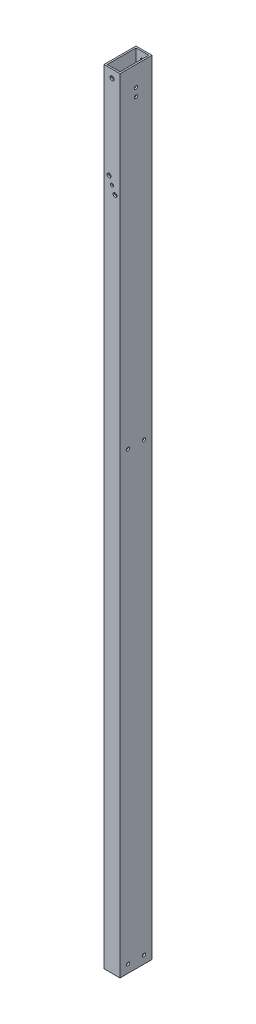
ISO-10303-21;
HEADER;
FILE_DESCRIPTION(('STEP AP214'),'2;1');
FILE_NAME('part.step','',(''),(''),'','','');
FILE_SCHEMA(('AUTOMOTIVE_DESIGN { 1 0 10303 214 1 1 1 1 }'));
ENDSEC;
DATA;
#1=APPLICATION_CONTEXT('core data for automotive mechanical design processes');
#2=APPLICATION_PROTOCOL_DEFINITION('international standard','automotive_design',2000,#1);
#3=PRODUCT_CONTEXT('',#1,'mechanical');
#4=PRODUCT('Part','Part','',(#3));
#5=PRODUCT_RELATED_PRODUCT_CATEGORY('part','',(#4));
#6=PRODUCT_DEFINITION_FORMATION('','',#4);
#7=PRODUCT_DEFINITION_CONTEXT('part definition',#1,'design');
#8=PRODUCT_DEFINITION('design','',#6,#7);
#9=PRODUCT_DEFINITION_SHAPE('','',#8);
#10=(LENGTH_UNIT() NAMED_UNIT(*) SI_UNIT(.MILLI.,.METRE.));
#11=(NAMED_UNIT(*) PLANE_ANGLE_UNIT() SI_UNIT($,.RADIAN.));
#12=(NAMED_UNIT(*) SI_UNIT($,.STERADIAN.) SOLID_ANGLE_UNIT());
#13=UNCERTAINTY_MEASURE_WITH_UNIT(LENGTH_MEASURE(1.E-05),#10,'distance_accuracy_value','');
#14=(GEOMETRIC_REPRESENTATION_CONTEXT(3) GLOBAL_UNCERTAINTY_ASSIGNED_CONTEXT((#13)) GLOBAL_UNIT_ASSIGNED_CONTEXT((#10,
#11,#12)) REPRESENTATION_CONTEXT('',''));
#15=CARTESIAN_POINT('',(0.,0.,0.));
#16=DIRECTION('',(0.,0.,1.));
#17=DIRECTION('',(1.,0.,0.));
#18=AXIS2_PLACEMENT_3D('',#15,#16,#17);
#19=CARTESIAN_POINT('',(0.,1244.6,0.));
#20=DIRECTION('',(0.,1.,0.));
#21=DIRECTION('',(0.,0.,1.));
#22=AXIS2_PLACEMENT_3D('',#19,#20,#21);
#23=PLANE('',#22);
#24=DIRECTION('',(0.,0.,1.));
#25=VECTOR('',#24,1.);
#26=CARTESIAN_POINT('',(0.,1244.6,0.));
#27=LINE('',#26,#25);
#28=CARTESIAN_POINT('',(0.,1244.6,-50.8));
#29=VERTEX_POINT('',#28);
#30=CARTESIAN_POINT('',(0.,1244.6,0.));
#31=VERTEX_POINT('',#30);
#32=EDGE_CURVE('E161',#29,#31,#27,.T.);
#33=ORIENTED_EDGE('',*,*,#32,.T.);
#34=DIRECTION('',(1.,0.,0.));
#35=VECTOR('',#34,1.);
#36=CARTESIAN_POINT('',(0.,1244.6,0.));
#37=LINE('',#36,#35);
#38=CARTESIAN_POINT('',(25.4,1244.6,0.));
#39=VERTEX_POINT('',#38);
#40=EDGE_CURVE('E164',#31,#39,#37,.T.);
#41=ORIENTED_EDGE('',*,*,#40,.T.);
#42=DIRECTION('',(0.,0.,-1.));
#43=VECTOR('',#42,1.);
#44=CARTESIAN_POINT('',(25.4,1244.6,0.));
#45=LINE('',#44,#43);
#46=CARTESIAN_POINT('',(25.4,1244.6,-50.8));
#47=VERTEX_POINT('',#46);
#48=EDGE_CURVE('E167',#39,#47,#45,.T.);
#49=ORIENTED_EDGE('',*,*,#48,.T.);
#50=DIRECTION('',(-1.,0.,0.));
#51=VECTOR('',#50,1.);
#52=CARTESIAN_POINT('',(0.,1244.6,-50.8));
#53=LINE('',#52,#51);
#54=EDGE_CURVE('E169',#47,#29,#53,.T.);
#55=ORIENTED_EDGE('',*,*,#54,.T.);
#56=EDGE_LOOP('',(#33,#41,#49,#55));
#57=FACE_BOUND('',#56,.T.);
#58=DIRECTION('',(1.,0.,0.));
#59=VECTOR('',#58,1.);
#60=CARTESIAN_POINT('',(0.,1244.6,-2.54));
#61=LINE('',#60,#59);
#62=CARTESIAN_POINT('',(2.54,1244.6,-2.54));
#63=VERTEX_POINT('',#62);
#64=CARTESIAN_POINT('',(22.86,1244.6,-2.54));
#65=VERTEX_POINT('',#64);
#66=EDGE_CURVE('E131',#63,#65,#61,.T.);
#67=ORIENTED_EDGE('',*,*,#66,.F.);
#68=DIRECTION('',(0.,0.,1.));
#69=VECTOR('',#68,1.);
#70=CARTESIAN_POINT('',(2.54,1244.6,0.));
#71=LINE('',#70,#69);
#72=CARTESIAN_POINT('',(2.54,1244.6,-48.26));
#73=VERTEX_POINT('',#72);
#74=EDGE_CURVE('E123',#73,#63,#71,.T.);
#75=ORIENTED_EDGE('',*,*,#74,.F.);
#76=DIRECTION('',(-1.,0.,0.));
#77=VECTOR('',#76,1.);
#78=CARTESIAN_POINT('',(0.,1244.6,-48.26));
#79=LINE('',#78,#77);
#80=CARTESIAN_POINT('',(22.86,1244.6,-48.26));
#81=VERTEX_POINT('',#80);
#82=EDGE_CURVE('E145',#81,#73,#79,.T.);
#83=ORIENTED_EDGE('',*,*,#82,.F.);
#84=DIRECTION('',(0.,0.,-1.));
#85=VECTOR('',#84,1.);
#86=CARTESIAN_POINT('',(22.86,1244.6,0.));
#87=LINE('',#86,#85);
#88=EDGE_CURVE('E143',#65,#81,#87,.T.);
#89=ORIENTED_EDGE('',*,*,#88,.F.);
#90=EDGE_LOOP('',(#67,#75,#83,#89));
#91=FACE_BOUND('',#90,.T.);
#92=ADVANCED_FACE('F56',(#57,#91),#23,.T.);
#93=CARTESIAN_POINT('',(0.,0.,0.));
#94=DIRECTION('',(0.,1.,0.));
#95=DIRECTION('',(0.,0.,1.));
#96=AXIS2_PLACEMENT_3D('',#93,#94,#95);
#97=PLANE('',#96);
#98=DIRECTION('',(0.,0.,1.));
#99=VECTOR('',#98,1.);
#100=CARTESIAN_POINT('',(0.,0.,0.));
#101=LINE('',#100,#99);
#102=CARTESIAN_POINT('',(0.,0.,-50.8));
#103=VERTEX_POINT('',#102);
#104=CARTESIAN_POINT('',(0.,0.,0.));
#105=VERTEX_POINT('',#104);
#106=EDGE_CURVE('E139',#103,#105,#101,.T.);
#107=ORIENTED_EDGE('',*,*,#106,.F.);
#108=DIRECTION('',(-1.,0.,0.));
#109=VECTOR('',#108,1.);
#110=CARTESIAN_POINT('',(0.,0.,-50.8));
#111=LINE('',#110,#109);
#112=CARTESIAN_POINT('',(25.4,0.,-50.8));
#113=VERTEX_POINT('',#112);
#114=EDGE_CURVE('E165',#113,#103,#111,.T.);
#115=ORIENTED_EDGE('',*,*,#114,.F.);
#116=DIRECTION('',(0.,0.,-1.));
#117=VECTOR('',#116,1.);
#118=CARTESIAN_POINT('',(25.4,0.,0.));
#119=LINE('',#118,#117);
#120=CARTESIAN_POINT('',(25.4,0.,0.));
#121=VERTEX_POINT('',#120);
#122=EDGE_CURVE('E176',#121,#113,#119,.T.);
#123=ORIENTED_EDGE('',*,*,#122,.F.);
#124=DIRECTION('',(1.,0.,0.));
#125=VECTOR('',#124,1.);
#126=CARTESIAN_POINT('',(0.,0.,0.));
#127=LINE('',#126,#125);
#128=EDGE_CURVE('E174',#105,#121,#127,.T.);
#129=ORIENTED_EDGE('',*,*,#128,.F.);
#130=EDGE_LOOP('',(#107,#115,#123,#129));
#131=FACE_BOUND('',#130,.T.);
#132=DIRECTION('',(0.,0.,1.));
#133=VECTOR('',#132,1.);
#134=CARTESIAN_POINT('',(2.54,0.,0.));
#135=LINE('',#134,#133);
#136=CARTESIAN_POINT('',(2.54,0.,-48.26));
#137=VERTEX_POINT('',#136);
#138=CARTESIAN_POINT('',(2.54,0.,-2.54));
#139=VERTEX_POINT('',#138);
#140=EDGE_CURVE('E81',#137,#139,#135,.T.);
#141=ORIENTED_EDGE('',*,*,#140,.T.);
#142=DIRECTION('',(1.,0.,0.));
#143=VECTOR('',#142,1.);
#144=CARTESIAN_POINT('',(0.,0.,-2.54));
#145=LINE('',#144,#143);
#146=CARTESIAN_POINT('',(22.86,0.,-2.54));
#147=VERTEX_POINT('',#146);
#148=EDGE_CURVE('E138',#139,#147,#145,.T.);
#149=ORIENTED_EDGE('',*,*,#148,.T.);
#150=DIRECTION('',(0.,0.,-1.));
#151=VECTOR('',#150,1.);
#152=CARTESIAN_POINT('',(22.86,0.,0.));
#153=LINE('',#152,#151);
#154=CARTESIAN_POINT('',(22.86,0.,-48.26));
#155=VERTEX_POINT('',#154);
#156=EDGE_CURVE('E153',#147,#155,#153,.T.);
#157=ORIENTED_EDGE('',*,*,#156,.T.);
#158=DIRECTION('',(-1.,0.,0.));
#159=VECTOR('',#158,1.);
#160=CARTESIAN_POINT('',(0.,0.,-48.26));
#161=LINE('',#160,#159);
#162=EDGE_CURVE('E132',#155,#137,#161,.T.);
#163=ORIENTED_EDGE('',*,*,#162,.T.);
#164=EDGE_LOOP('',(#141,#149,#157,#163));
#165=FACE_BOUND('',#164,.T.);
#166=ADVANCED_FACE('F326',(#131,#165),#97,.F.);
#167=CARTESIAN_POINT('',(0.,1244.6,0.));
#168=DIRECTION('',(1.,0.,0.));
#169=DIRECTION('',(0.,0.,-1.));
#170=AXIS2_PLACEMENT_3D('',#167,#168,#169);
#171=PLANE('',#170);
#172=CARTESIAN_POINT('',(0.,721.632068305735,-38.1000000000045));
#173=DIRECTION('',(-1.,0.,0.));
#174=DIRECTION('',(0.,0.,1.));
#175=AXIS2_PLACEMENT_3D('',#172,#173,#174);
#176=CIRCLE('',#175,2.50189999999115);
#177=CARTESIAN_POINT('',(0.,721.632068305735,-35.5981000000134));
#178=VERTEX_POINT('',#177);
#179=EDGE_CURVE('E270',#178,#178,#176,.T.);
#180=ORIENTED_EDGE('',*,*,#179,.F.);
#181=EDGE_LOOP('',(#180));
#182=FACE_BOUND('',#181,.T.);
#183=CARTESIAN_POINT('',(0.,12.960193372522,-12.7));
#184=DIRECTION('',(-1.,0.,0.));
#185=DIRECTION('',(0.,0.,1.));
#186=AXIS2_PLACEMENT_3D('',#183,#184,#185);
#187=CIRCLE('',#186,2.48919999999999);
#188=CARTESIAN_POINT('',(0.,12.960193372522,-10.2108));
#189=VERTEX_POINT('',#188);
#190=EDGE_CURVE('E263',#189,#189,#187,.T.);
#191=ORIENTED_EDGE('',*,*,#190,.F.);
#192=EDGE_LOOP('',(#191));
#193=FACE_BOUND('',#192,.T.);
#194=CARTESIAN_POINT('',(0.,12.7,-38.1));
#195=DIRECTION('',(-1.,0.,0.));
#196=DIRECTION('',(0.,0.,1.));
#197=AXIS2_PLACEMENT_3D('',#194,#195,#196);
#198=CIRCLE('',#197,2.48919999999999);
#199=CARTESIAN_POINT('',(0.,12.7,-35.6108));
#200=VERTEX_POINT('',#199);
#201=EDGE_CURVE('E259',#200,#200,#198,.T.);
#202=ORIENTED_EDGE('',*,*,#201,.F.);
#203=EDGE_LOOP('',(#202));
#204=FACE_BOUND('',#203,.T.);
#205=CARTESIAN_POINT('',(0.,721.632068305735,-12.7000000000045));
#206=DIRECTION('',(-1.,0.,0.));
#207=DIRECTION('',(0.,0.,1.));
#208=AXIS2_PLACEMENT_3D('',#205,#206,#207);
#209=CIRCLE('',#208,2.50189999999115);
#210=CARTESIAN_POINT('',(0.,721.632068305735,-10.1981000000133));
#211=VERTEX_POINT('',#210);
#212=EDGE_CURVE('E269',#211,#211,#209,.T.);
#213=ORIENTED_EDGE('',*,*,#212,.F.);
#214=EDGE_LOOP('',(#213));
#215=FACE_BOUND('',#214,.T.);
#216=CARTESIAN_POINT('',(0.,1200.15,-25.4));
#217=DIRECTION('',(1.,0.,0.));
#218=DIRECTION('',(0.,0.,-1.));
#219=AXIS2_PLACEMENT_3D('',#216,#217,#218);
#220=CIRCLE('',#219,2.48920000000002);
#221=CARTESIAN_POINT('',(0.,1200.15,-27.8892000000001));
#222=VERTEX_POINT('',#221);
#223=EDGE_CURVE('E190',#222,#222,#220,.T.);
#224=ORIENTED_EDGE('',*,*,#223,.T.);
#225=EDGE_LOOP('',(#224));
#226=FACE_BOUND('',#225,.T.);
#227=CARTESIAN_POINT('',(0.,1212.85,-25.4));
#228=DIRECTION('',(1.,0.,0.));
#229=DIRECTION('',(0.,0.,-1.));
#230=AXIS2_PLACEMENT_3D('',#227,#228,#229);
#231=CIRCLE('',#230,2.48920000000002);
#232=CARTESIAN_POINT('',(0.,1212.85,-27.8892000000001));
#233=VERTEX_POINT('',#232);
#234=EDGE_CURVE('E296',#233,#233,#231,.T.);
#235=ORIENTED_EDGE('',*,*,#234,.T.);
#236=EDGE_LOOP('',(#235));
#237=FACE_BOUND('',#236,.T.);
#238=ORIENTED_EDGE('',*,*,#106,.T.);
#239=DIRECTION('',(0.,-1.,0.));
#240=VECTOR('',#239,1.);
#241=CARTESIAN_POINT('',(0.,1244.6,0.));
#242=LINE('',#241,#240);
#243=EDGE_CURVE('E12',#31,#105,#242,.T.);
#244=ORIENTED_EDGE('',*,*,#243,.F.);
#245=ORIENTED_EDGE('',*,*,#32,.F.);
#246=DIRECTION('',(0.,-1.,0.));
#247=VECTOR('',#246,1.);
#248=CARTESIAN_POINT('',(0.,1244.6,-50.8));
#249=LINE('',#248,#247);
#250=EDGE_CURVE('E171',#29,#103,#249,.T.);
#251=ORIENTED_EDGE('',*,*,#250,.T.);
#252=EDGE_LOOP('',(#238,#244,#245,#251));
#253=FACE_BOUND('',#252,.T.);
#254=ADVANCED_FACE('F58',(#182,#193,#204,#215,#226,#237,#253),#171,.F.);
#255=CARTESIAN_POINT('',(0.,1244.6,0.));
#256=DIRECTION('',(0.,0.,-1.));
#257=DIRECTION('',(-1.,0.,0.));
#258=AXIS2_PLACEMENT_3D('',#255,#256,#257);
#259=PLANE('',#258);
#260=CARTESIAN_POINT('',(7.9375,1095.9170868,0.));
#261=DIRECTION('',(0.,0.,1.));
#262=DIRECTION('',(1.,0.,0.));
#263=AXIS2_PLACEMENT_3D('',#260,#261,#262);
#264=CIRCLE('',#263,3.17500000000028);
#265=CARTESIAN_POINT('',(11.1125000000003,1095.9170868,0.));
#266=VERTEX_POINT('',#265);
#267=EDGE_CURVE('E229',#266,#266,#264,.T.);
#268=ORIENTED_EDGE('',*,*,#267,.F.);
#269=EDGE_LOOP('',(#268));
#270=FACE_BOUND('',#269,.T.);
#271=CARTESIAN_POINT('',(17.4625,1073.6920868,0.));
#272=DIRECTION('',(0.,0.,1.));
#273=DIRECTION('',(1.,0.,0.));
#274=AXIS2_PLACEMENT_3D('',#271,#272,#273);
#275=CIRCLE('',#274,3.17500000000028);
#276=CARTESIAN_POINT('',(20.6375000000003,1073.6920868,0.));
#277=VERTEX_POINT('',#276);
#278=EDGE_CURVE('E239',#277,#277,#275,.T.);
#279=ORIENTED_EDGE('',*,*,#278,.F.);
#280=EDGE_LOOP('',(#279));
#281=FACE_BOUND('',#280,.T.);
#282=CARTESIAN_POINT('',(12.7,1231.9,0.));
#283=DIRECTION('',(0.,0.,-1.));
#284=DIRECTION('',(-1.,0.,0.));
#285=AXIS2_PLACEMENT_3D('',#282,#283,#284);
#286=CIRCLE('',#285,3.17500000000003);
#287=CARTESIAN_POINT('',(9.52499999999997,1231.9,0.));
#288=VERTEX_POINT('',#287);
#289=EDGE_CURVE('E219',#288,#288,#286,.T.);
#290=ORIENTED_EDGE('',*,*,#289,.T.);
#291=EDGE_LOOP('',(#290));
#292=FACE_BOUND('',#291,.T.);
#293=CARTESIAN_POINT('',(12.7,1084.8045868,0.));
#294=DIRECTION('',(0.,0.,-1.));
#295=DIRECTION('',(-1.,0.,0.));
#296=AXIS2_PLACEMENT_3D('',#293,#294,#295);
#297=CIRCLE('',#296,2.48920000000002);
#298=CARTESIAN_POINT('',(10.2108,1084.8045868,0.));
#299=VERTEX_POINT('',#298);
#300=EDGE_CURVE('E215',#299,#299,#297,.T.);
#301=ORIENTED_EDGE('',*,*,#300,.T.);
#302=EDGE_LOOP('',(#301));
#303=FACE_BOUND('',#302,.T.);
#304=ORIENTED_EDGE('',*,*,#128,.T.);
#305=DIRECTION('',(0.,-1.,0.));
#306=VECTOR('',#305,1.);
#307=CARTESIAN_POINT('',(25.4,1244.6,0.));
#308=LINE('',#307,#306);
#309=EDGE_CURVE('E65',#39,#121,#308,.T.);
#310=ORIENTED_EDGE('',*,*,#309,.F.);
#311=ORIENTED_EDGE('',*,*,#40,.F.);
#312=ORIENTED_EDGE('',*,*,#243,.T.);
#313=EDGE_LOOP('',(#304,#310,#311,#312));
#314=FACE_BOUND('',#313,.T.);
#315=ADVANCED_FACE('F325',(#270,#281,#292,#303,#314),#259,.F.);
#316=CARTESIAN_POINT('',(25.4,1244.6,0.));
#317=DIRECTION('',(-1.,0.,0.));
#318=DIRECTION('',(0.,0.,1.));
#319=AXIS2_PLACEMENT_3D('',#316,#317,#318);
#320=PLANE('',#319);
#321=CARTESIAN_POINT('',(25.4,721.632068305735,-38.1000000000045));
#322=DIRECTION('',(-1.,0.,0.));
#323=DIRECTION('',(0.,0.,1.));
#324=AXIS2_PLACEMENT_3D('',#321,#322,#323);
#325=CIRCLE('',#324,2.50189999999115);
#326=CARTESIAN_POINT('',(25.4,721.632068305735,-35.5981000000134));
#327=VERTEX_POINT('',#326);
#328=EDGE_CURVE('E266',#327,#327,#325,.T.);
#329=ORIENTED_EDGE('',*,*,#328,.T.);
#330=EDGE_LOOP('',(#329));
#331=FACE_BOUND('',#330,.T.);
#332=CARTESIAN_POINT('',(25.4,12.960193372522,-12.7));
#333=DIRECTION('',(-1.,0.,0.));
#334=DIRECTION('',(0.,0.,1.));
#335=AXIS2_PLACEMENT_3D('',#332,#333,#334);
#336=CIRCLE('',#335,2.48919999999999);
#337=CARTESIAN_POINT('',(25.4,12.960193372522,-10.2108));
#338=VERTEX_POINT('',#337);
#339=EDGE_CURVE('E273',#338,#338,#336,.T.);
#340=ORIENTED_EDGE('',*,*,#339,.T.);
#341=EDGE_LOOP('',(#340));
#342=FACE_BOUND('',#341,.T.);
#343=CARTESIAN_POINT('',(25.4,12.7,-38.1));
#344=DIRECTION('',(-1.,0.,0.));
#345=DIRECTION('',(0.,0.,1.));
#346=AXIS2_PLACEMENT_3D('',#343,#344,#345);
#347=CIRCLE('',#346,2.48919999999999);
#348=CARTESIAN_POINT('',(25.4,12.7,-35.6108));
#349=VERTEX_POINT('',#348);
#350=EDGE_CURVE('E260',#349,#349,#347,.T.);
#351=ORIENTED_EDGE('',*,*,#350,.T.);
#352=EDGE_LOOP('',(#351));
#353=FACE_BOUND('',#352,.T.);
#354=CARTESIAN_POINT('',(25.4,721.632068305735,-12.7000000000045));
#355=DIRECTION('',(-1.,0.,0.));
#356=DIRECTION('',(0.,0.,1.));
#357=AXIS2_PLACEMENT_3D('',#354,#355,#356);
#358=CIRCLE('',#357,2.50189999999115);
#359=CARTESIAN_POINT('',(25.4,721.632068305735,-10.1981000000133));
#360=VERTEX_POINT('',#359);
#361=EDGE_CURVE('E198',#360,#360,#358,.T.);
#362=ORIENTED_EDGE('',*,*,#361,.T.);
#363=EDGE_LOOP('',(#362));
#364=FACE_BOUND('',#363,.T.);
#365=CARTESIAN_POINT('',(25.4,1200.15,-25.4));
#366=DIRECTION('',(1.,0.,0.));
#367=DIRECTION('',(0.,0.,-1.));
#368=AXIS2_PLACEMENT_3D('',#365,#366,#367);
#369=CIRCLE('',#368,2.48920000000002);
#370=CARTESIAN_POINT('',(25.4,1200.15,-27.8892000000001));
#371=VERTEX_POINT('',#370);
#372=EDGE_CURVE('E293',#371,#371,#369,.T.);
#373=ORIENTED_EDGE('',*,*,#372,.F.);
#374=EDGE_LOOP('',(#373));
#375=FACE_BOUND('',#374,.T.);
#376=CARTESIAN_POINT('',(25.4,1212.85,-25.4));
#377=DIRECTION('',(1.,0.,0.));
#378=DIRECTION('',(0.,0.,-1.));
#379=AXIS2_PLACEMENT_3D('',#376,#377,#378);
#380=CIRCLE('',#379,2.48920000000002);
#381=CARTESIAN_POINT('',(25.4,1212.85,-27.8892000000001));
#382=VERTEX_POINT('',#381);
#383=EDGE_CURVE('E290',#382,#382,#380,.T.);
#384=ORIENTED_EDGE('',*,*,#383,.F.);
#385=EDGE_LOOP('',(#384));
#386=FACE_BOUND('',#385,.T.);
#387=ORIENTED_EDGE('',*,*,#122,.T.);
#388=DIRECTION('',(0.,-1.,0.));
#389=VECTOR('',#388,1.);
#390=CARTESIAN_POINT('',(25.4,1244.6,-50.8));
#391=LINE('',#390,#389);
#392=EDGE_CURVE('E181',#47,#113,#391,.T.);
#393=ORIENTED_EDGE('',*,*,#392,.F.);
#394=ORIENTED_EDGE('',*,*,#48,.F.);
#395=ORIENTED_EDGE('',*,*,#309,.T.);
#396=EDGE_LOOP('',(#387,#393,#394,#395));
#397=FACE_BOUND('',#396,.T.);
#398=ADVANCED_FACE('F344',(#331,#342,#353,#364,#375,#386,#397),#320,.F.);
#399=CARTESIAN_POINT('',(0.,1244.6,-50.8));
#400=DIRECTION('',(0.,0.,1.));
#401=DIRECTION('',(1.,0.,0.));
#402=AXIS2_PLACEMENT_3D('',#399,#400,#401);
#403=PLANE('',#402);
#404=CARTESIAN_POINT('',(7.9375,1095.9170868,-50.8));
#405=DIRECTION('',(0.,0.,1.));
#406=DIRECTION('',(1.,0.,0.));
#407=AXIS2_PLACEMENT_3D('',#404,#405,#406);
#408=CIRCLE('',#407,3.17500000000028);
#409=CARTESIAN_POINT('',(11.1125000000003,1095.9170868,-50.8));
#410=VERTEX_POINT('',#409);
#411=EDGE_CURVE('E223',#410,#410,#408,.T.);
#412=ORIENTED_EDGE('',*,*,#411,.T.);
#413=EDGE_LOOP('',(#412));
#414=FACE_BOUND('',#413,.T.);
#415=CARTESIAN_POINT('',(17.4625,1073.6920868,-50.8));
#416=DIRECTION('',(0.,0.,1.));
#417=DIRECTION('',(1.,0.,0.));
#418=AXIS2_PLACEMENT_3D('',#415,#416,#417);
#419=CIRCLE('',#418,3.17500000000028);
#420=CARTESIAN_POINT('',(20.6375000000003,1073.6920868,-50.8));
#421=VERTEX_POINT('',#420);
#422=EDGE_CURVE('E234',#421,#421,#419,.T.);
#423=ORIENTED_EDGE('',*,*,#422,.T.);
#424=EDGE_LOOP('',(#423));
#425=FACE_BOUND('',#424,.T.);
#426=CARTESIAN_POINT('',(12.7,1231.9,-50.8));
#427=DIRECTION('',(0.,0.,-1.));
#428=DIRECTION('',(-1.,0.,0.));
#429=AXIS2_PLACEMENT_3D('',#426,#427,#428);
#430=CIRCLE('',#429,3.17500000000003);
#431=CARTESIAN_POINT('',(9.52499999999997,1231.9,-50.8));
#432=VERTEX_POINT('',#431);
#433=EDGE_CURVE('E245',#432,#432,#430,.T.);
#434=ORIENTED_EDGE('',*,*,#433,.F.);
#435=EDGE_LOOP('',(#434));
#436=FACE_BOUND('',#435,.T.);
#437=CARTESIAN_POINT('',(12.7,1084.8045868,-50.8));
#438=DIRECTION('',(0.,0.,-1.));
#439=DIRECTION('',(-1.,0.,0.));
#440=AXIS2_PLACEMENT_3D('',#437,#438,#439);
#441=CIRCLE('',#440,2.48920000000002);
#442=CARTESIAN_POINT('',(10.2108,1084.8045868,-50.8));
#443=VERTEX_POINT('',#442);
#444=EDGE_CURVE('E252',#443,#443,#441,.T.);
#445=ORIENTED_EDGE('',*,*,#444,.F.);
#446=EDGE_LOOP('',(#445));
#447=FACE_BOUND('',#446,.T.);
#448=ORIENTED_EDGE('',*,*,#114,.T.);
#449=ORIENTED_EDGE('',*,*,#250,.F.);
#450=ORIENTED_EDGE('',*,*,#54,.F.);
#451=ORIENTED_EDGE('',*,*,#392,.T.);
#452=EDGE_LOOP('',(#448,#449,#450,#451));
#453=FACE_BOUND('',#452,.T.);
#454=ADVANCED_FACE('F310',(#414,#425,#436,#447,#453),#403,.F.);
#455=CARTESIAN_POINT('',(2.54,1244.6,0.));
#456=DIRECTION('',(1.,0.,0.));
#457=DIRECTION('',(0.,0.,-1.));
#458=AXIS2_PLACEMENT_3D('',#455,#456,#457);
#459=PLANE('',#458);
#460=CARTESIAN_POINT('',(2.54,721.632068305735,-38.1000000000045));
#461=DIRECTION('',(1.,0.,0.));
#462=DIRECTION('',(0.,0.,-1.));
#463=AXIS2_PLACEMENT_3D('',#460,#461,#462);
#464=CIRCLE('',#463,2.50189999999115);
#465=CARTESIAN_POINT('',(2.54,721.632068305735,-40.6018999999956));
#466=VERTEX_POINT('',#465);
#467=EDGE_CURVE('E210',#466,#466,#464,.T.);
#468=ORIENTED_EDGE('',*,*,#467,.F.);
#469=EDGE_LOOP('',(#468));
#470=FACE_BOUND('',#469,.T.);
#471=CARTESIAN_POINT('',(2.54,12.960193372522,-12.7));
#472=DIRECTION('',(1.,0.,0.));
#473=DIRECTION('',(0.,0.,-1.));
#474=AXIS2_PLACEMENT_3D('',#471,#472,#473);
#475=CIRCLE('',#474,2.48919999999999);
#476=CARTESIAN_POINT('',(2.54,12.960193372522,-15.1892));
#477=VERTEX_POINT('',#476);
#478=EDGE_CURVE('E206',#477,#477,#475,.T.);
#479=ORIENTED_EDGE('',*,*,#478,.F.);
#480=EDGE_LOOP('',(#479));
#481=FACE_BOUND('',#480,.T.);
#482=CARTESIAN_POINT('',(2.54,12.7,-38.1));
#483=DIRECTION('',(1.,0.,0.));
#484=DIRECTION('',(0.,0.,-1.));
#485=AXIS2_PLACEMENT_3D('',#482,#483,#484);
#486=CIRCLE('',#485,2.48919999999999);
#487=CARTESIAN_POINT('',(2.54,12.7,-40.5892));
#488=VERTEX_POINT('',#487);
#489=EDGE_CURVE('E202',#488,#488,#486,.T.);
#490=ORIENTED_EDGE('',*,*,#489,.F.);
#491=EDGE_LOOP('',(#490));
#492=FACE_BOUND('',#491,.T.);
#493=CARTESIAN_POINT('',(2.54,721.632068305735,-12.7000000000045));
#494=DIRECTION('',(1.,0.,0.));
#495=DIRECTION('',(0.,0.,-1.));
#496=AXIS2_PLACEMENT_3D('',#493,#494,#495);
#497=CIRCLE('',#496,2.50189999999115);
#498=CARTESIAN_POINT('',(2.54,721.632068305735,-15.2018999999957));
#499=VERTEX_POINT('',#498);
#500=EDGE_CURVE('E197',#499,#499,#497,.T.);
#501=ORIENTED_EDGE('',*,*,#500,.F.);
#502=EDGE_LOOP('',(#501));
#503=FACE_BOUND('',#502,.T.);
#504=CARTESIAN_POINT('',(2.54,1200.15,-25.4));
#505=DIRECTION('',(1.,0.,0.));
#506=DIRECTION('',(0.,0.,-1.));
#507=AXIS2_PLACEMENT_3D('',#504,#505,#506);
#508=CIRCLE('',#507,2.48920000000002);
#509=CARTESIAN_POINT('',(2.54,1200.15,-27.8892000000001));
#510=VERTEX_POINT('',#509);
#511=EDGE_CURVE('E151',#510,#510,#508,.T.);
#512=ORIENTED_EDGE('',*,*,#511,.F.);
#513=EDGE_LOOP('',(#512));
#514=FACE_BOUND('',#513,.T.);
#515=CARTESIAN_POINT('',(2.54,1212.85,-25.4));
#516=DIRECTION('',(1.,0.,0.));
#517=DIRECTION('',(0.,0.,-1.));
#518=AXIS2_PLACEMENT_3D('',#515,#516,#517);
#519=CIRCLE('',#518,2.48920000000002);
#520=CARTESIAN_POINT('',(2.54,1212.85,-27.8892000000001));
#521=VERTEX_POINT('',#520);
#522=EDGE_CURVE('E189',#521,#521,#519,.T.);
#523=ORIENTED_EDGE('',*,*,#522,.F.);
#524=EDGE_LOOP('',(#523));
#525=FACE_BOUND('',#524,.T.);
#526=ORIENTED_EDGE('',*,*,#140,.F.);
#527=DIRECTION('',(0.,-1.,0.));
#528=VECTOR('',#527,1.);
#529=CARTESIAN_POINT('',(2.54,1244.6,-48.26));
#530=LINE('',#529,#528);
#531=EDGE_CURVE('E127',#73,#137,#530,.T.);
#532=ORIENTED_EDGE('',*,*,#531,.F.);
#533=ORIENTED_EDGE('',*,*,#74,.T.);
#534=DIRECTION('',(0.,-1.,0.));
#535=VECTOR('',#534,1.);
#536=CARTESIAN_POINT('',(2.54,1244.6,-2.54));
#537=LINE('',#536,#535);
#538=EDGE_CURVE('E126',#63,#139,#537,.T.);
#539=ORIENTED_EDGE('',*,*,#538,.T.);
#540=EDGE_LOOP('',(#526,#532,#533,#539));
#541=FACE_BOUND('',#540,.T.);
#542=ADVANCED_FACE('F125',(#470,#481,#492,#503,#514,#525,#541),#459,.T.);
#543=CARTESIAN_POINT('',(0.,1244.6,-2.54));
#544=DIRECTION('',(0.,0.,-1.));
#545=DIRECTION('',(-1.,0.,0.));
#546=AXIS2_PLACEMENT_3D('',#543,#544,#545);
#547=PLANE('',#546);
#548=CARTESIAN_POINT('',(7.9375,1095.9170868,-2.54));
#549=DIRECTION('',(0.,0.,-1.));
#550=DIRECTION('',(-1.,0.,0.));
#551=AXIS2_PLACEMENT_3D('',#548,#549,#550);
#552=CIRCLE('',#551,3.17500000000028);
#553=CARTESIAN_POINT('',(4.76249999999972,1095.9170868,-2.54));
#554=VERTEX_POINT('',#553);
#555=EDGE_CURVE('E242',#554,#554,#552,.T.);
#556=ORIENTED_EDGE('',*,*,#555,.F.);
#557=EDGE_LOOP('',(#556));
#558=FACE_BOUND('',#557,.T.);
#559=CARTESIAN_POINT('',(17.4625,1073.6920868,-2.54));
#560=DIRECTION('',(0.,0.,-1.));
#561=DIRECTION('',(-1.,0.,0.));
#562=AXIS2_PLACEMENT_3D('',#559,#560,#561);
#563=CIRCLE('',#562,3.17500000000028);
#564=CARTESIAN_POINT('',(14.2874999999997,1073.6920868,-2.54));
#565=VERTEX_POINT('',#564);
#566=EDGE_CURVE('E222',#565,#565,#563,.T.);
#567=ORIENTED_EDGE('',*,*,#566,.F.);
#568=EDGE_LOOP('',(#567));
#569=FACE_BOUND('',#568,.T.);
#570=CARTESIAN_POINT('',(12.7,1231.9,-2.54));
#571=DIRECTION('',(0.,0.,-1.));
#572=DIRECTION('',(-1.,0.,0.));
#573=AXIS2_PLACEMENT_3D('',#570,#571,#572);
#574=CIRCLE('',#573,3.17500000000003);
#575=CARTESIAN_POINT('',(9.52499999999997,1231.9,-2.54));
#576=VERTEX_POINT('',#575);
#577=EDGE_CURVE('E218',#576,#576,#574,.T.);
#578=ORIENTED_EDGE('',*,*,#577,.F.);
#579=EDGE_LOOP('',(#578));
#580=FACE_BOUND('',#579,.T.);
#581=CARTESIAN_POINT('',(12.7,1084.8045868,-2.54));
#582=DIRECTION('',(0.,0.,-1.));
#583=DIRECTION('',(-1.,0.,0.));
#584=AXIS2_PLACEMENT_3D('',#581,#582,#583);
#585=CIRCLE('',#584,2.48920000000002);
#586=CARTESIAN_POINT('',(10.2108,1084.8045868,-2.54));
#587=VERTEX_POINT('',#586);
#588=EDGE_CURVE('E214',#587,#587,#585,.T.);
#589=ORIENTED_EDGE('',*,*,#588,.F.);
#590=EDGE_LOOP('',(#589));
#591=FACE_BOUND('',#590,.T.);
#592=ORIENTED_EDGE('',*,*,#148,.F.);
#593=ORIENTED_EDGE('',*,*,#538,.F.);
#594=ORIENTED_EDGE('',*,*,#66,.T.);
#595=DIRECTION('',(0.,-1.,0.));
#596=VECTOR('',#595,1.);
#597=CARTESIAN_POINT('',(22.86,1244.6,-2.54));
#598=LINE('',#597,#596);
#599=EDGE_CURVE('E140',#65,#147,#598,.T.);
#600=ORIENTED_EDGE('',*,*,#599,.T.);
#601=EDGE_LOOP('',(#592,#593,#594,#600));
#602=FACE_BOUND('',#601,.T.);
#603=ADVANCED_FACE('F135',(#558,#569,#580,#591,#602),#547,.T.);
#604=CARTESIAN_POINT('',(22.86,1244.6,0.));
#605=DIRECTION('',(-1.,0.,0.));
#606=DIRECTION('',(0.,0.,1.));
#607=AXIS2_PLACEMENT_3D('',#604,#605,#606);
#608=PLANE('',#607);
#609=CARTESIAN_POINT('',(22.86,721.632068305735,-38.1000000000045));
#610=DIRECTION('',(-1.,0.,0.));
#611=DIRECTION('',(0.,0.,1.));
#612=AXIS2_PLACEMENT_3D('',#609,#610,#611);
#613=CIRCLE('',#612,2.50189999999115);
#614=CARTESIAN_POINT('',(22.86,721.632068305735,-35.5981000000134));
#615=VERTEX_POINT('',#614);
#616=EDGE_CURVE('E207',#615,#615,#613,.T.);
#617=ORIENTED_EDGE('',*,*,#616,.F.);
#618=EDGE_LOOP('',(#617));
#619=FACE_BOUND('',#618,.T.);
#620=CARTESIAN_POINT('',(22.86,12.960193372522,-12.7));
#621=DIRECTION('',(-1.,0.,0.));
#622=DIRECTION('',(0.,0.,1.));
#623=AXIS2_PLACEMENT_3D('',#620,#621,#622);
#624=CIRCLE('',#623,2.48919999999999);
#625=CARTESIAN_POINT('',(22.86,12.960193372522,-10.2108));
#626=VERTEX_POINT('',#625);
#627=EDGE_CURVE('E203',#626,#626,#624,.T.);
#628=ORIENTED_EDGE('',*,*,#627,.F.);
#629=EDGE_LOOP('',(#628));
#630=FACE_BOUND('',#629,.T.);
#631=CARTESIAN_POINT('',(22.86,12.7,-38.1));
#632=DIRECTION('',(-1.,0.,0.));
#633=DIRECTION('',(0.,0.,1.));
#634=AXIS2_PLACEMENT_3D('',#631,#632,#633);
#635=CIRCLE('',#634,2.48919999999999);
#636=CARTESIAN_POINT('',(22.86,12.7,-35.6108));
#637=VERTEX_POINT('',#636);
#638=EDGE_CURVE('E199',#637,#637,#635,.T.);
#639=ORIENTED_EDGE('',*,*,#638,.F.);
#640=EDGE_LOOP('',(#639));
#641=FACE_BOUND('',#640,.T.);
#642=CARTESIAN_POINT('',(22.86,721.632068305735,-12.7000000000045));
#643=DIRECTION('',(-1.,0.,0.));
#644=DIRECTION('',(0.,0.,1.));
#645=AXIS2_PLACEMENT_3D('',#642,#643,#644);
#646=CIRCLE('',#645,2.50189999999115);
#647=CARTESIAN_POINT('',(22.86,721.632068305735,-10.1981000000133));
#648=VERTEX_POINT('',#647);
#649=EDGE_CURVE('E194',#648,#648,#646,.T.);
#650=ORIENTED_EDGE('',*,*,#649,.F.);
#651=EDGE_LOOP('',(#650));
#652=FACE_BOUND('',#651,.T.);
#653=CARTESIAN_POINT('',(22.86,1200.15,-25.4));
#654=DIRECTION('',(-1.,0.,0.));
#655=DIRECTION('',(0.,0.,1.));
#656=AXIS2_PLACEMENT_3D('',#653,#654,#655);
#657=CIRCLE('',#656,2.48920000000002);
#658=CARTESIAN_POINT('',(22.86,1200.15,-22.9108));
#659=VERTEX_POINT('',#658);
#660=EDGE_CURVE('E191',#659,#659,#657,.T.);
#661=ORIENTED_EDGE('',*,*,#660,.F.);
#662=EDGE_LOOP('',(#661));
#663=FACE_BOUND('',#662,.T.);
#664=CARTESIAN_POINT('',(22.86,1212.85,-25.4));
#665=DIRECTION('',(-1.,0.,0.));
#666=DIRECTION('',(0.,0.,1.));
#667=AXIS2_PLACEMENT_3D('',#664,#665,#666);
#668=CIRCLE('',#667,2.48920000000002);
#669=CARTESIAN_POINT('',(22.86,1212.85,-22.9108));
#670=VERTEX_POINT('',#669);
#671=EDGE_CURVE('E186',#670,#670,#668,.T.);
#672=ORIENTED_EDGE('',*,*,#671,.F.);
#673=EDGE_LOOP('',(#672));
#674=FACE_BOUND('',#673,.T.);
#675=ORIENTED_EDGE('',*,*,#156,.F.);
#676=ORIENTED_EDGE('',*,*,#599,.F.);
#677=ORIENTED_EDGE('',*,*,#88,.T.);
#678=DIRECTION('',(0.,-1.,0.));
#679=VECTOR('',#678,1.);
#680=CARTESIAN_POINT('',(22.86,1244.6,-48.26));
#681=LINE('',#680,#679);
#682=EDGE_CURVE('E73',#81,#155,#681,.T.);
#683=ORIENTED_EDGE('',*,*,#682,.T.);
#684=EDGE_LOOP('',(#675,#676,#677,#683));
#685=FACE_BOUND('',#684,.T.);
#686=ADVANCED_FACE('F364',(#619,#630,#641,#652,#663,#674,#685),#608,.T.);
#687=CARTESIAN_POINT('',(0.,1244.6,-48.26));
#688=DIRECTION('',(0.,0.,1.));
#689=DIRECTION('',(1.,0.,0.));
#690=AXIS2_PLACEMENT_3D('',#687,#688,#689);
#691=PLANE('',#690);
#692=CARTESIAN_POINT('',(7.9375,1095.9170868,-48.26));
#693=DIRECTION('',(0.,0.,1.));
#694=DIRECTION('',(1.,0.,0.));
#695=AXIS2_PLACEMENT_3D('',#692,#693,#694);
#696=CIRCLE('',#695,3.17500000000028);
#697=CARTESIAN_POINT('',(11.1125000000003,1095.9170868,-48.26));
#698=VERTEX_POINT('',#697);
#699=EDGE_CURVE('E60',#698,#698,#696,.T.);
#700=ORIENTED_EDGE('',*,*,#699,.F.);
#701=EDGE_LOOP('',(#700));
#702=FACE_BOUND('',#701,.T.);
#703=CARTESIAN_POINT('',(17.4625,1073.6920868,-48.26));
#704=DIRECTION('',(0.,0.,1.));
#705=DIRECTION('',(1.,0.,0.));
#706=AXIS2_PLACEMENT_3D('',#703,#704,#705);
#707=CIRCLE('',#706,3.17500000000028);
#708=CARTESIAN_POINT('',(20.6375000000003,1073.6920868,-48.26));
#709=VERTEX_POINT('',#708);
#710=EDGE_CURVE('E220',#709,#709,#707,.T.);
#711=ORIENTED_EDGE('',*,*,#710,.F.);
#712=EDGE_LOOP('',(#711));
#713=FACE_BOUND('',#712,.T.);
#714=CARTESIAN_POINT('',(12.7,1231.9,-48.26));
#715=DIRECTION('',(0.,0.,1.));
#716=DIRECTION('',(1.,0.,0.));
#717=AXIS2_PLACEMENT_3D('',#714,#715,#716);
#718=CIRCLE('',#717,3.17500000000003);
#719=CARTESIAN_POINT('',(15.875,1231.9,-48.26));
#720=VERTEX_POINT('',#719);
#721=EDGE_CURVE('E216',#720,#720,#718,.T.);
#722=ORIENTED_EDGE('',*,*,#721,.F.);
#723=EDGE_LOOP('',(#722));
#724=FACE_BOUND('',#723,.T.);
#725=CARTESIAN_POINT('',(12.7,1084.8045868,-48.26));
#726=DIRECTION('',(0.,0.,1.));
#727=DIRECTION('',(1.,0.,0.));
#728=AXIS2_PLACEMENT_3D('',#725,#726,#727);
#729=CIRCLE('',#728,2.48920000000002);
#730=CARTESIAN_POINT('',(15.1892,1084.8045868,-48.26));
#731=VERTEX_POINT('',#730);
#732=EDGE_CURVE('E211',#731,#731,#729,.T.);
#733=ORIENTED_EDGE('',*,*,#732,.F.);
#734=EDGE_LOOP('',(#733));
#735=FACE_BOUND('',#734,.T.);
#736=ORIENTED_EDGE('',*,*,#162,.F.);
#737=ORIENTED_EDGE('',*,*,#682,.F.);
#738=ORIENTED_EDGE('',*,*,#82,.T.);
#739=ORIENTED_EDGE('',*,*,#531,.T.);
#740=EDGE_LOOP('',(#736,#737,#738,#739));
#741=FACE_BOUND('',#740,.T.);
#742=ADVANCED_FACE('F368',(#702,#713,#724,#735,#741),#691,.T.);
#743=CARTESIAN_POINT('',(0.,1212.85,-25.4));
#744=DIRECTION('',(1.,0.,0.));
#745=DIRECTION('',(0.,0.,-1.));
#746=AXIS2_PLACEMENT_3D('',#743,#744,#745);
#747=CYLINDRICAL_SURFACE('',#746,2.48920000000002);
#748=ORIENTED_EDGE('',*,*,#671,.T.);
#749=EDGE_LOOP('',(#748));
#750=FACE_BOUND('',#749,.T.);
#751=ORIENTED_EDGE('',*,*,#383,.T.);
#752=EDGE_LOOP('',(#751));
#753=FACE_BOUND('',#752,.T.);
#754=ADVANCED_FACE('F320',(#750,#753),#747,.F.);
#755=CARTESIAN_POINT('',(0.,1200.15,-25.4));
#756=DIRECTION('',(1.,0.,0.));
#757=DIRECTION('',(0.,0.,-1.));
#758=AXIS2_PLACEMENT_3D('',#755,#756,#757);
#759=CYLINDRICAL_SURFACE('',#758,2.48920000000002);
#760=ORIENTED_EDGE('',*,*,#660,.T.);
#761=EDGE_LOOP('',(#760));
#762=FACE_BOUND('',#761,.T.);
#763=ORIENTED_EDGE('',*,*,#372,.T.);
#764=EDGE_LOOP('',(#763));
#765=FACE_BOUND('',#764,.T.);
#766=ADVANCED_FACE('F318',(#762,#765),#759,.F.);
#767=ORIENTED_EDGE('',*,*,#522,.T.);
#768=EDGE_LOOP('',(#767));
#769=FACE_BOUND('',#768,.T.);
#770=ORIENTED_EDGE('',*,*,#234,.F.);
#771=EDGE_LOOP('',(#770));
#772=FACE_BOUND('',#771,.T.);
#773=ADVANCED_FACE('F315',(#769,#772),#747,.F.);
#774=ORIENTED_EDGE('',*,*,#511,.T.);
#775=EDGE_LOOP('',(#774));
#776=FACE_BOUND('',#775,.T.);
#777=ORIENTED_EDGE('',*,*,#223,.F.);
#778=EDGE_LOOP('',(#777));
#779=FACE_BOUND('',#778,.T.);
#780=ADVANCED_FACE('F305',(#776,#779),#759,.F.);
#781=CARTESIAN_POINT('',(25.4,721.632068305735,-12.7000000000045));
#782=DIRECTION('',(-1.,0.,0.));
#783=DIRECTION('',(0.,0.,1.));
#784=AXIS2_PLACEMENT_3D('',#781,#782,#783);
#785=CYLINDRICAL_SURFACE('',#784,2.50189999999115);
#786=ORIENTED_EDGE('',*,*,#649,.T.);
#787=EDGE_LOOP('',(#786));
#788=FACE_BOUND('',#787,.T.);
#789=ORIENTED_EDGE('',*,*,#361,.F.);
#790=EDGE_LOOP('',(#789));
#791=FACE_BOUND('',#790,.T.);
#792=ADVANCED_FACE('F378',(#788,#791),#785,.F.);
#793=CARTESIAN_POINT('',(25.4,12.7,-38.1));
#794=DIRECTION('',(-1.,0.,0.));
#795=DIRECTION('',(0.,0.,1.));
#796=AXIS2_PLACEMENT_3D('',#793,#794,#795);
#797=CYLINDRICAL_SURFACE('',#796,2.48919999999999);
#798=ORIENTED_EDGE('',*,*,#638,.T.);
#799=EDGE_LOOP('',(#798));
#800=FACE_BOUND('',#799,.T.);
#801=ORIENTED_EDGE('',*,*,#350,.F.);
#802=EDGE_LOOP('',(#801));
#803=FACE_BOUND('',#802,.T.);
#804=ADVANCED_FACE('F381',(#800,#803),#797,.F.);
#805=CARTESIAN_POINT('',(25.4,12.960193372522,-12.7));
#806=DIRECTION('',(-1.,0.,0.));
#807=DIRECTION('',(0.,0.,1.));
#808=AXIS2_PLACEMENT_3D('',#805,#806,#807);
#809=CYLINDRICAL_SURFACE('',#808,2.48919999999999);
#810=ORIENTED_EDGE('',*,*,#627,.T.);
#811=EDGE_LOOP('',(#810));
#812=FACE_BOUND('',#811,.T.);
#813=ORIENTED_EDGE('',*,*,#339,.F.);
#814=EDGE_LOOP('',(#813));
#815=FACE_BOUND('',#814,.T.);
#816=ADVANCED_FACE('F384',(#812,#815),#809,.F.);
#817=CARTESIAN_POINT('',(25.4,721.632068305735,-38.1000000000045));
#818=DIRECTION('',(-1.,0.,0.));
#819=DIRECTION('',(0.,0.,1.));
#820=AXIS2_PLACEMENT_3D('',#817,#818,#819);
#821=CYLINDRICAL_SURFACE('',#820,2.50189999999115);
#822=ORIENTED_EDGE('',*,*,#616,.T.);
#823=EDGE_LOOP('',(#822));
#824=FACE_BOUND('',#823,.T.);
#825=ORIENTED_EDGE('',*,*,#328,.F.);
#826=EDGE_LOOP('',(#825));
#827=FACE_BOUND('',#826,.T.);
#828=ADVANCED_FACE('F387',(#824,#827),#821,.F.);
#829=ORIENTED_EDGE('',*,*,#500,.T.);
#830=EDGE_LOOP('',(#829));
#831=FACE_BOUND('',#830,.T.);
#832=ORIENTED_EDGE('',*,*,#212,.T.);
#833=EDGE_LOOP('',(#832));
#834=FACE_BOUND('',#833,.T.);
#835=ADVANCED_FACE('F383',(#831,#834),#785,.F.);
#836=ORIENTED_EDGE('',*,*,#489,.T.);
#837=EDGE_LOOP('',(#836));
#838=FACE_BOUND('',#837,.T.);
#839=ORIENTED_EDGE('',*,*,#201,.T.);
#840=EDGE_LOOP('',(#839));
#841=FACE_BOUND('',#840,.T.);
#842=ADVANCED_FACE('F397',(#838,#841),#797,.F.);
#843=ORIENTED_EDGE('',*,*,#478,.T.);
#844=EDGE_LOOP('',(#843));
#845=FACE_BOUND('',#844,.T.);
#846=ORIENTED_EDGE('',*,*,#190,.T.);
#847=EDGE_LOOP('',(#846));
#848=FACE_BOUND('',#847,.T.);
#849=ADVANCED_FACE('F389',(#845,#848),#809,.F.);
#850=ORIENTED_EDGE('',*,*,#467,.T.);
#851=EDGE_LOOP('',(#850));
#852=FACE_BOUND('',#851,.T.);
#853=ORIENTED_EDGE('',*,*,#179,.T.);
#854=EDGE_LOOP('',(#853));
#855=FACE_BOUND('',#854,.T.);
#856=ADVANCED_FACE('F393',(#852,#855),#821,.F.);
#857=CARTESIAN_POINT('',(12.7,1084.8045868,0.));
#858=DIRECTION('',(0.,0.,-1.));
#859=DIRECTION('',(-1.,0.,0.));
#860=AXIS2_PLACEMENT_3D('',#857,#858,#859);
#861=CYLINDRICAL_SURFACE('',#860,2.48920000000002);
#862=ORIENTED_EDGE('',*,*,#732,.T.);
#863=EDGE_LOOP('',(#862));
#864=FACE_BOUND('',#863,.T.);
#865=ORIENTED_EDGE('',*,*,#444,.T.);
#866=EDGE_LOOP('',(#865));
#867=FACE_BOUND('',#866,.T.);
#868=ADVANCED_FACE('F398',(#864,#867),#861,.F.);
#869=ORIENTED_EDGE('',*,*,#588,.T.);
#870=EDGE_LOOP('',(#869));
#871=FACE_BOUND('',#870,.T.);
#872=ORIENTED_EDGE('',*,*,#300,.F.);
#873=EDGE_LOOP('',(#872));
#874=FACE_BOUND('',#873,.T.);
#875=ADVANCED_FACE('F401',(#871,#874),#861,.F.);
#876=CARTESIAN_POINT('',(12.7,1231.9,0.));
#877=DIRECTION('',(0.,0.,-1.));
#878=DIRECTION('',(-1.,0.,0.));
#879=AXIS2_PLACEMENT_3D('',#876,#877,#878);
#880=CYLINDRICAL_SURFACE('',#879,3.17500000000003);
#881=ORIENTED_EDGE('',*,*,#721,.T.);
#882=EDGE_LOOP('',(#881));
#883=FACE_BOUND('',#882,.T.);
#884=ORIENTED_EDGE('',*,*,#433,.T.);
#885=EDGE_LOOP('',(#884));
#886=FACE_BOUND('',#885,.T.);
#887=ADVANCED_FACE('F403',(#883,#886),#880,.F.);
#888=ORIENTED_EDGE('',*,*,#577,.T.);
#889=EDGE_LOOP('',(#888));
#890=FACE_BOUND('',#889,.T.);
#891=ORIENTED_EDGE('',*,*,#289,.F.);
#892=EDGE_LOOP('',(#891));
#893=FACE_BOUND('',#892,.T.);
#894=ADVANCED_FACE('F406',(#890,#893),#880,.F.);
#895=CARTESIAN_POINT('',(17.4625,1073.6920868,-50.8));
#896=DIRECTION('',(0.,0.,1.));
#897=DIRECTION('',(1.,0.,0.));
#898=AXIS2_PLACEMENT_3D('',#895,#896,#897);
#899=CYLINDRICAL_SURFACE('',#898,3.17500000000028);
#900=ORIENTED_EDGE('',*,*,#710,.T.);
#901=EDGE_LOOP('',(#900));
#902=FACE_BOUND('',#901,.T.);
#903=ORIENTED_EDGE('',*,*,#422,.F.);
#904=EDGE_LOOP('',(#903));
#905=FACE_BOUND('',#904,.T.);
#906=ADVANCED_FACE('F408',(#902,#905),#899,.F.);
#907=CARTESIAN_POINT('',(7.9375,1095.9170868,-50.8));
#908=DIRECTION('',(0.,0.,1.));
#909=DIRECTION('',(1.,0.,0.));
#910=AXIS2_PLACEMENT_3D('',#907,#908,#909);
#911=CYLINDRICAL_SURFACE('',#910,3.17500000000028);
#912=ORIENTED_EDGE('',*,*,#699,.T.);
#913=EDGE_LOOP('',(#912));
#914=FACE_BOUND('',#913,.T.);
#915=ORIENTED_EDGE('',*,*,#411,.F.);
#916=EDGE_LOOP('',(#915));
#917=FACE_BOUND('',#916,.T.);
#918=ADVANCED_FACE('F411',(#914,#917),#911,.F.);
#919=ORIENTED_EDGE('',*,*,#566,.T.);
#920=EDGE_LOOP('',(#919));
#921=FACE_BOUND('',#920,.T.);
#922=ORIENTED_EDGE('',*,*,#278,.T.);
#923=EDGE_LOOP('',(#922));
#924=FACE_BOUND('',#923,.T.);
#925=ADVANCED_FACE('F412',(#921,#924),#899,.F.);
#926=ORIENTED_EDGE('',*,*,#555,.T.);
#927=EDGE_LOOP('',(#926));
#928=FACE_BOUND('',#927,.T.);
#929=ORIENTED_EDGE('',*,*,#267,.T.);
#930=EDGE_LOOP('',(#929));
#931=FACE_BOUND('',#930,.T.);
#932=ADVANCED_FACE('F415',(#928,#931),#911,.F.);
#933=CLOSED_SHELL('',(#92,#166,#254,#315,#398,#454,#542,#603,#686,#742,#754,#766,#773,#780,#792,
#804,#816,#828,#835,#842,#849,#856,#868,#875,#887,#894,#906,#918,#925,#932));
#934=MANIFOLD_SOLID_BREP('B2',#933);
#935=ADVANCED_BREP_SHAPE_REPRESENTATION('',(#18,#934),#14);
#936=SHAPE_DEFINITION_REPRESENTATION(#9,#935);
ENDSEC;
END-ISO-10303-21;
